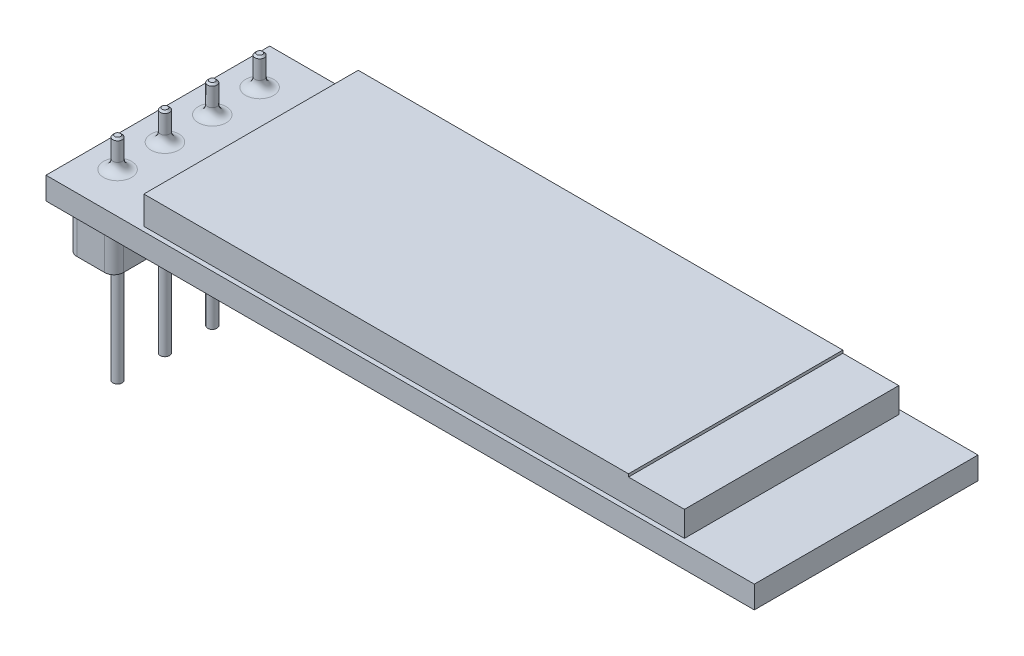
ISO-10303-21;
HEADER;
FILE_DESCRIPTION(('STEP AP214'),'2;1');
FILE_NAME('part.step','',(''),(''),'','','');
FILE_SCHEMA(('AUTOMOTIVE_DESIGN { 1 0 10303 214 1 1 1 1 }'));
ENDSEC;
DATA;
#1=APPLICATION_CONTEXT('core data for automotive mechanical design processes');
#2=APPLICATION_PROTOCOL_DEFINITION('international standard','automotive_design',2000,#1);
#3=PRODUCT_CONTEXT('',#1,'mechanical');
#4=PRODUCT('Part','Part','',(#3));
#5=PRODUCT_RELATED_PRODUCT_CATEGORY('part','',(#4));
#6=PRODUCT_DEFINITION_FORMATION('','',#4);
#7=PRODUCT_DEFINITION_CONTEXT('part definition',#1,'design');
#8=PRODUCT_DEFINITION('design','',#6,#7);
#9=PRODUCT_DEFINITION_SHAPE('','',#8);
#10=(LENGTH_UNIT() NAMED_UNIT(*) SI_UNIT(.MILLI.,.METRE.));
#11=(NAMED_UNIT(*) PLANE_ANGLE_UNIT() SI_UNIT($,.RADIAN.));
#12=(NAMED_UNIT(*) SI_UNIT($,.STERADIAN.) SOLID_ANGLE_UNIT());
#13=UNCERTAINTY_MEASURE_WITH_UNIT(LENGTH_MEASURE(1.E-05),#10,'distance_accuracy_value','');
#14=(GEOMETRIC_REPRESENTATION_CONTEXT(3) GLOBAL_UNCERTAINTY_ASSIGNED_CONTEXT((#13)) GLOBAL_UNIT_ASSIGNED_CONTEXT((#10,
#11,#12)) REPRESENTATION_CONTEXT('',''));
#15=CARTESIAN_POINT('',(0.,0.,0.));
#16=DIRECTION('',(0.,0.,1.));
#17=DIRECTION('',(1.,0.,0.));
#18=AXIS2_PLACEMENT_3D('',#15,#16,#17);
#19=CARTESIAN_POINT('',(0.,0.,0.));
#20=DIRECTION('',(0.,-1.,0.));
#21=DIRECTION('',(0.,0.,-1.));
#22=AXIS2_PLACEMENT_3D('',#19,#20,#21);
#23=PLANE('',#22);
#24=DIRECTION('',(0.,0.,-1.));
#25=VECTOR('',#24,1.);
#26=CARTESIAN_POINT('',(19.,0.,6.));
#27=LINE('',#26,#25);
#28=CARTESIAN_POINT('',(19.,0.,6.));
#29=VERTEX_POINT('',#28);
#30=CARTESIAN_POINT('',(19.,0.,-6.));
#31=VERTEX_POINT('',#30);
#32=EDGE_CURVE('E198',#29,#31,#27,.T.);
#33=ORIENTED_EDGE('',*,*,#32,.F.);
#34=DIRECTION('',(1.,0.,0.));
#35=VECTOR('',#34,1.);
#36=CARTESIAN_POINT('',(-19.,0.,6.));
#37=LINE('',#36,#35);
#38=CARTESIAN_POINT('',(-19.,0.,6.));
#39=VERTEX_POINT('',#38);
#40=EDGE_CURVE('E216',#39,#29,#37,.T.);
#41=ORIENTED_EDGE('',*,*,#40,.F.);
#42=DIRECTION('',(0.,0.,1.));
#43=VECTOR('',#42,1.);
#44=CARTESIAN_POINT('',(-19.,0.,6.));
#45=LINE('',#44,#43);
#46=CARTESIAN_POINT('',(-19.,0.,-6.));
#47=VERTEX_POINT('',#46);
#48=EDGE_CURVE('E228',#47,#39,#45,.T.);
#49=ORIENTED_EDGE('',*,*,#48,.F.);
#50=DIRECTION('',(-1.,0.,0.));
#51=VECTOR('',#50,1.);
#52=CARTESIAN_POINT('',(-19.,0.,-6.));
#53=LINE('',#52,#51);
#54=EDGE_CURVE('E204',#31,#47,#53,.T.);
#55=ORIENTED_EDGE('',*,*,#54,.F.);
#56=EDGE_LOOP('',(#33,#41,#49,#55));
#57=FACE_BOUND('',#56,.T.);
#58=DIRECTION('',(-1.,0.,0.));
#59=VECTOR('',#58,1.);
#60=CARTESIAN_POINT('',(-18.6,0.,5.25));
#61=LINE('',#60,#59);
#62=CARTESIAN_POINT('',(-16.6,0.,5.25));
#63=VERTEX_POINT('',#62);
#64=CARTESIAN_POINT('',(-18.1,0.,5.25));
#65=VERTEX_POINT('',#64);
#66=EDGE_CURVE('E467',#63,#65,#61,.T.);
#67=ORIENTED_EDGE('',*,*,#66,.F.);
#68=CARTESIAN_POINT('',(-16.6,0.,4.75));
#69=DIRECTION('',(0.,-1.,0.));
#70=DIRECTION('',(0.,0.,-1.));
#71=AXIS2_PLACEMENT_3D('',#68,#69,#70);
#72=CIRCLE('',#71,0.5);
#73=CARTESIAN_POINT('',(-16.1,0.,4.75));
#74=VERTEX_POINT('',#73);
#75=EDGE_CURVE('E350',#63,#74,#72,.F.);
#76=ORIENTED_EDGE('',*,*,#75,.T.);
#77=DIRECTION('',(0.,0.,1.));
#78=VECTOR('',#77,1.);
#79=CARTESIAN_POINT('',(-16.1,0.,5.25));
#80=LINE('',#79,#78);
#81=CARTESIAN_POINT('',(-16.1,0.,-4.74999999999999));
#82=VERTEX_POINT('',#81);
#83=EDGE_CURVE('E446',#82,#74,#80,.T.);
#84=ORIENTED_EDGE('',*,*,#83,.F.);
#85=CARTESIAN_POINT('',(-16.6,0.,-4.75));
#86=DIRECTION('',(0.,-1.,0.));
#87=DIRECTION('',(0.,0.,-1.));
#88=AXIS2_PLACEMENT_3D('',#85,#86,#87);
#89=CIRCLE('',#88,0.5);
#90=CARTESIAN_POINT('',(-16.6,0.,-5.25));
#91=VERTEX_POINT('',#90);
#92=EDGE_CURVE('E55',#82,#91,#89,.F.);
#93=ORIENTED_EDGE('',*,*,#92,.T.);
#94=DIRECTION('',(1.,0.,0.));
#95=VECTOR('',#94,1.);
#96=CARTESIAN_POINT('',(-18.6,0.,-5.25));
#97=LINE('',#96,#95);
#98=CARTESIAN_POINT('',(-18.1,0.,-5.25));
#99=VERTEX_POINT('',#98);
#100=EDGE_CURVE('E369',#99,#91,#97,.T.);
#101=ORIENTED_EDGE('',*,*,#100,.F.);
#102=CARTESIAN_POINT('',(-18.1,0.,-4.75));
#103=DIRECTION('',(0.,-1.,0.));
#104=DIRECTION('',(0.,0.,-1.));
#105=AXIS2_PLACEMENT_3D('',#102,#103,#104);
#106=CIRCLE('',#105,0.5);
#107=CARTESIAN_POINT('',(-18.6,0.,-4.74999999999999));
#108=VERTEX_POINT('',#107);
#109=EDGE_CURVE('E11',#99,#108,#106,.F.);
#110=ORIENTED_EDGE('',*,*,#109,.T.);
#111=DIRECTION('',(0.,0.,-1.));
#112=VECTOR('',#111,1.);
#113=CARTESIAN_POINT('',(-18.6,0.,5.25));
#114=LINE('',#113,#112);
#115=CARTESIAN_POINT('',(-18.6,0.,4.75));
#116=VERTEX_POINT('',#115);
#117=EDGE_CURVE('E470',#116,#108,#114,.T.);
#118=ORIENTED_EDGE('',*,*,#117,.F.);
#119=CARTESIAN_POINT('',(-18.1,0.,4.75));
#120=DIRECTION('',(0.,-1.,0.));
#121=DIRECTION('',(0.,0.,-1.));
#122=AXIS2_PLACEMENT_3D('',#119,#120,#121);
#123=CIRCLE('',#122,0.5);
#124=EDGE_CURVE('E353',#116,#65,#123,.F.);
#125=ORIENTED_EDGE('',*,*,#124,.T.);
#126=EDGE_LOOP('',(#67,#76,#84,#93,#101,#110,#118,#125));
#127=FACE_BOUND('',#126,.T.);
#128=ADVANCED_FACE('F46',(#57,#127),#23,.T.);
#129=CARTESIAN_POINT('',(-17.35,2.8,-3.81));
#130=DIRECTION('',(0.,-1.,0.));
#131=DIRECTION('',(0.,0.,-1.));
#132=AXIS2_PLACEMENT_3D('',#129,#130,#131);
#133=CONICAL_SURFACE('',#132,0.150000000000008,0.785398163397434);
#134=CARTESIAN_POINT('',(-17.35,2.70000000000001,-3.81));
#135=DIRECTION('',(0.,1.,0.));
#136=DIRECTION('',(0.,0.,1.));
#137=AXIS2_PLACEMENT_3D('',#134,#135,#136);
#138=CIRCLE('',#137,0.25);
#139=CARTESIAN_POINT('',(-17.35,2.70000000000001,-3.56));
#140=VERTEX_POINT('',#139);
#141=EDGE_CURVE('E288',#140,#140,#138,.F.);
#142=ORIENTED_EDGE('',*,*,#141,.F.);
#143=EDGE_LOOP('',(#142));
#144=FACE_BOUND('',#143,.T.);
#145=CARTESIAN_POINT('',(-17.35,2.8,-3.81));
#146=DIRECTION('',(0.,1.,0.));
#147=DIRECTION('',(0.,0.,1.));
#148=AXIS2_PLACEMENT_3D('',#145,#146,#147);
#149=CIRCLE('',#148,0.150000000000008);
#150=CARTESIAN_POINT('',(-17.35,2.8,-3.65999999999999));
#151=VERTEX_POINT('',#150);
#152=EDGE_CURVE('E292',#151,#151,#149,.T.);
#153=ORIENTED_EDGE('',*,*,#152,.F.);
#154=EDGE_LOOP('',(#153));
#155=FACE_BOUND('',#154,.T.);
#156=ADVANCED_FACE('F510',(#144,#155),#133,.T.);
#157=CARTESIAN_POINT('',(-17.35,2.8,-3.81));
#158=DIRECTION('',(0.,1.,0.));
#159=DIRECTION('',(0.,0.,1.));
#160=AXIS2_PLACEMENT_3D('',#157,#158,#159);
#161=PLANE('',#160);
#162=ORIENTED_EDGE('',*,*,#152,.T.);
#163=EDGE_LOOP('',(#162));
#164=FACE_BOUND('',#163,.T.);
#165=ADVANCED_FACE('F516',(#164),#161,.T.);
#166=CARTESIAN_POINT('',(-17.35,-8.6,-3.81));
#167=DIRECTION('',(0.,1.,0.));
#168=DIRECTION('',(0.,0.,1.));
#169=AXIS2_PLACEMENT_3D('',#166,#167,#168);
#170=CYLINDRICAL_SURFACE('',#169,0.25);
#171=CARTESIAN_POINT('',(-17.35,1.7,-3.81));
#172=DIRECTION('',(0.,-1.,0.));
#173=DIRECTION('',(0.,0.,-1.));
#174=AXIS2_PLACEMENT_3D('',#171,#172,#173);
#175=CIRCLE('',#174,0.25);
#176=CARTESIAN_POINT('',(-17.35,1.7,-4.06));
#177=VERTEX_POINT('',#176);
#178=EDGE_CURVE('E284',#177,#177,#175,.F.);
#179=ORIENTED_EDGE('',*,*,#178,.T.);
#180=EDGE_LOOP('',(#179));
#181=FACE_BOUND('',#180,.T.);
#182=ORIENTED_EDGE('',*,*,#141,.T.);
#183=EDGE_LOOP('',(#182));
#184=FACE_BOUND('',#183,.T.);
#185=ADVANCED_FACE('F576',(#181,#184),#170,.T.);
#186=CARTESIAN_POINT('',(-17.35,1.7,-3.81));
#187=DIRECTION('',(0.,-1.,0.));
#188=DIRECTION('',(0.,0.,-1.));
#189=AXIS2_PLACEMENT_3D('',#186,#187,#188);
#190=TOROIDAL_SURFACE('',#189,0.75,0.5);
#191=ORIENTED_EDGE('',*,*,#178,.F.);
#192=EDGE_LOOP('',(#191));
#193=FACE_BOUND('',#192,.T.);
#194=CARTESIAN_POINT('',(-17.35,1.2,-3.81));
#195=DIRECTION('',(0.,-1.,0.));
#196=DIRECTION('',(0.,0.,-1.));
#197=AXIS2_PLACEMENT_3D('',#194,#195,#196);
#198=CIRCLE('',#197,0.75);
#199=CARTESIAN_POINT('',(-17.35,1.2,-4.56));
#200=VERTEX_POINT('',#199);
#201=EDGE_CURVE('E280',#200,#200,#198,.T.);
#202=ORIENTED_EDGE('',*,*,#201,.F.);
#203=EDGE_LOOP('',(#202));
#204=FACE_BOUND('',#203,.T.);
#205=ADVANCED_FACE('F572',(#193,#204),#190,.F.);
#206=CARTESIAN_POINT('',(-17.35,2.8,-1.27));
#207=DIRECTION('',(0.,-1.,0.));
#208=DIRECTION('',(0.,0.,-1.));
#209=AXIS2_PLACEMENT_3D('',#206,#207,#208);
#210=CONICAL_SURFACE('',#209,0.150000000000008,0.785398163397434);
#211=CARTESIAN_POINT('',(-17.35,2.70000000000001,-1.27));
#212=DIRECTION('',(0.,1.,0.));
#213=DIRECTION('',(0.,0.,1.));
#214=AXIS2_PLACEMENT_3D('',#211,#212,#213);
#215=CIRCLE('',#214,0.25);
#216=CARTESIAN_POINT('',(-17.35,2.70000000000001,-1.02));
#217=VERTEX_POINT('',#216);
#218=EDGE_CURVE('E272',#217,#217,#215,.F.);
#219=ORIENTED_EDGE('',*,*,#218,.F.);
#220=EDGE_LOOP('',(#219));
#221=FACE_BOUND('',#220,.T.);
#222=CARTESIAN_POINT('',(-17.35,2.8,-1.27));
#223=DIRECTION('',(0.,1.,0.));
#224=DIRECTION('',(0.,0.,1.));
#225=AXIS2_PLACEMENT_3D('',#222,#223,#224);
#226=CIRCLE('',#225,0.150000000000008);
#227=CARTESIAN_POINT('',(-17.35,2.8,-1.11999999999999));
#228=VERTEX_POINT('',#227);
#229=EDGE_CURVE('E276',#228,#228,#226,.T.);
#230=ORIENTED_EDGE('',*,*,#229,.F.);
#231=EDGE_LOOP('',(#230));
#232=FACE_BOUND('',#231,.T.);
#233=ADVANCED_FACE('F564',(#221,#232),#210,.T.);
#234=CARTESIAN_POINT('',(-17.35,2.8,-1.27));
#235=DIRECTION('',(0.,1.,0.));
#236=DIRECTION('',(0.,0.,1.));
#237=AXIS2_PLACEMENT_3D('',#234,#235,#236);
#238=PLANE('',#237);
#239=ORIENTED_EDGE('',*,*,#229,.T.);
#240=EDGE_LOOP('',(#239));
#241=FACE_BOUND('',#240,.T.);
#242=ADVANCED_FACE('F560',(#241),#238,.T.);
#243=CARTESIAN_POINT('',(-17.35,-8.6,-1.27));
#244=DIRECTION('',(0.,1.,0.));
#245=DIRECTION('',(0.,0.,1.));
#246=AXIS2_PLACEMENT_3D('',#243,#244,#245);
#247=CYLINDRICAL_SURFACE('',#246,0.25);
#248=CARTESIAN_POINT('',(-17.35,1.7,-1.27));
#249=DIRECTION('',(0.,-1.,0.));
#250=DIRECTION('',(0.,0.,-1.));
#251=AXIS2_PLACEMENT_3D('',#248,#249,#250);
#252=CIRCLE('',#251,0.25);
#253=CARTESIAN_POINT('',(-17.35,1.7,-1.52));
#254=VERTEX_POINT('',#253);
#255=EDGE_CURVE('E268',#254,#254,#252,.F.);
#256=ORIENTED_EDGE('',*,*,#255,.T.);
#257=EDGE_LOOP('',(#256));
#258=FACE_BOUND('',#257,.T.);
#259=ORIENTED_EDGE('',*,*,#218,.T.);
#260=EDGE_LOOP('',(#259));
#261=FACE_BOUND('',#260,.T.);
#262=ADVANCED_FACE('F556',(#258,#261),#247,.T.);
#263=CARTESIAN_POINT('',(-17.35,1.7,-1.27));
#264=DIRECTION('',(0.,-1.,0.));
#265=DIRECTION('',(0.,0.,-1.));
#266=AXIS2_PLACEMENT_3D('',#263,#264,#265);
#267=TOROIDAL_SURFACE('',#266,0.75,0.5);
#268=ORIENTED_EDGE('',*,*,#255,.F.);
#269=EDGE_LOOP('',(#268));
#270=FACE_BOUND('',#269,.T.);
#271=CARTESIAN_POINT('',(-17.35,1.2,-1.27));
#272=DIRECTION('',(0.,-1.,0.));
#273=DIRECTION('',(0.,0.,-1.));
#274=AXIS2_PLACEMENT_3D('',#271,#272,#273);
#275=CIRCLE('',#274,0.75);
#276=CARTESIAN_POINT('',(-17.35,1.2,-2.02));
#277=VERTEX_POINT('',#276);
#278=EDGE_CURVE('E264',#277,#277,#275,.T.);
#279=ORIENTED_EDGE('',*,*,#278,.F.);
#280=EDGE_LOOP('',(#279));
#281=FACE_BOUND('',#280,.T.);
#282=ADVANCED_FACE('F553',(#270,#281),#267,.F.);
#283=CARTESIAN_POINT('',(0.,1.2,0.));
#284=DIRECTION('',(0.,-1.,0.));
#285=DIRECTION('',(0.,0.,-1.));
#286=AXIS2_PLACEMENT_3D('',#283,#284,#285);
#287=PLANE('',#286);
#288=CARTESIAN_POINT('',(-17.35,1.2,1.27));
#289=DIRECTION('',(0.,-1.,0.));
#290=DIRECTION('',(0.,0.,-1.));
#291=AXIS2_PLACEMENT_3D('',#288,#289,#290);
#292=CIRCLE('',#291,0.75);
#293=CARTESIAN_POINT('',(-17.35,1.2,0.52));
#294=VERTEX_POINT('',#293);
#295=EDGE_CURVE('E376',#294,#294,#292,.T.);
#296=ORIENTED_EDGE('',*,*,#295,.T.);
#297=EDGE_LOOP('',(#296));
#298=FACE_BOUND('',#297,.T.);
#299=CARTESIAN_POINT('',(-17.35,1.2,3.81));
#300=DIRECTION('',(0.,-1.,0.));
#301=DIRECTION('',(0.,0.,-1.));
#302=AXIS2_PLACEMENT_3D('',#299,#300,#301);
#303=CIRCLE('',#302,0.75);
#304=CARTESIAN_POINT('',(-17.35,1.2,3.06));
#305=VERTEX_POINT('',#304);
#306=EDGE_CURVE('E256',#305,#305,#303,.T.);
#307=ORIENTED_EDGE('',*,*,#306,.T.);
#308=EDGE_LOOP('',(#307));
#309=FACE_BOUND('',#308,.T.);
#310=DIRECTION('',(0.,0.,-1.));
#311=VECTOR('',#310,1.);
#312=CARTESIAN_POINT('',(19.,1.2,6.));
#313=LINE('',#312,#311);
#314=CARTESIAN_POINT('',(19.,1.2,6.));
#315=VERTEX_POINT('',#314);
#316=CARTESIAN_POINT('',(19.,1.2,-6.));
#317=VERTEX_POINT('',#316);
#318=EDGE_CURVE('E211',#315,#317,#313,.T.);
#319=ORIENTED_EDGE('',*,*,#318,.T.);
#320=DIRECTION('',(-1.,0.,0.));
#321=VECTOR('',#320,1.);
#322=CARTESIAN_POINT('',(-19.,1.2,-6.));
#323=LINE('',#322,#321);
#324=CARTESIAN_POINT('',(-19.,1.2,-6.));
#325=VERTEX_POINT('',#324);
#326=EDGE_CURVE('E215',#317,#325,#323,.T.);
#327=ORIENTED_EDGE('',*,*,#326,.T.);
#328=DIRECTION('',(0.,0.,1.));
#329=VECTOR('',#328,1.);
#330=CARTESIAN_POINT('',(-19.,1.2,6.));
#331=LINE('',#330,#329);
#332=CARTESIAN_POINT('',(-19.,1.2,6.));
#333=VERTEX_POINT('',#332);
#334=EDGE_CURVE('E219',#325,#333,#331,.T.);
#335=ORIENTED_EDGE('',*,*,#334,.T.);
#336=DIRECTION('',(1.,0.,0.));
#337=VECTOR('',#336,1.);
#338=CARTESIAN_POINT('',(-19.,1.2,6.));
#339=LINE('',#338,#337);
#340=EDGE_CURVE('E222',#333,#315,#339,.T.);
#341=ORIENTED_EDGE('',*,*,#340,.T.);
#342=EDGE_LOOP('',(#319,#327,#335,#341));
#343=FACE_BOUND('',#342,.T.);
#344=DIRECTION('',(0.,0.,-1.));
#345=VECTOR('',#344,1.);
#346=CARTESIAN_POINT('',(15.,1.2,5.75));
#347=LINE('',#346,#345);
#348=CARTESIAN_POINT('',(15.,1.2,5.75));
#349=VERTEX_POINT('',#348);
#350=CARTESIAN_POINT('',(15.,1.2,-5.75));
#351=VERTEX_POINT('',#350);
#352=EDGE_CURVE('E196',#349,#351,#347,.T.);
#353=ORIENTED_EDGE('',*,*,#352,.F.);
#354=DIRECTION('',(1.,0.,0.));
#355=VECTOR('',#354,1.);
#356=CARTESIAN_POINT('',(-14.,1.2,5.75));
#357=LINE('',#356,#355);
#358=CARTESIAN_POINT('',(-14.,1.2,5.75));
#359=VERTEX_POINT('',#358);
#360=EDGE_CURVE('E401',#359,#349,#357,.T.);
#361=ORIENTED_EDGE('',*,*,#360,.F.);
#362=DIRECTION('',(0.,0.,1.));
#363=VECTOR('',#362,1.);
#364=CARTESIAN_POINT('',(-14.,1.2,5.75));
#365=LINE('',#364,#363);
#366=CARTESIAN_POINT('',(-14.,1.2,-5.75));
#367=VERTEX_POINT('',#366);
#368=EDGE_CURVE('E414',#367,#359,#365,.T.);
#369=ORIENTED_EDGE('',*,*,#368,.F.);
#370=DIRECTION('',(-1.,0.,0.));
#371=VECTOR('',#370,1.);
#372=CARTESIAN_POINT('',(-14.,1.2,-5.75));
#373=LINE('',#372,#371);
#374=EDGE_CURVE('E411',#351,#367,#373,.T.);
#375=ORIENTED_EDGE('',*,*,#374,.F.);
#376=EDGE_LOOP('',(#353,#361,#369,#375));
#377=FACE_BOUND('',#376,.T.);
#378=ORIENTED_EDGE('',*,*,#278,.T.);
#379=EDGE_LOOP('',(#378));
#380=FACE_BOUND('',#379,.T.);
#381=ORIENTED_EDGE('',*,*,#201,.T.);
#382=EDGE_LOOP('',(#381));
#383=FACE_BOUND('',#382,.T.);
#384=ADVANCED_FACE('F434',(#298,#309,#343,#377,#380,#383),#287,.F.);
#385=CARTESIAN_POINT('',(19.,1.2,6.));
#386=DIRECTION('',(-1.,0.,0.));
#387=DIRECTION('',(0.,0.,1.));
#388=AXIS2_PLACEMENT_3D('',#385,#386,#387);
#389=PLANE('',#388);
#390=ORIENTED_EDGE('',*,*,#32,.T.);
#391=DIRECTION('',(0.,-1.,0.));
#392=VECTOR('',#391,1.);
#393=CARTESIAN_POINT('',(19.,1.2,-6.));
#394=LINE('',#393,#392);
#395=EDGE_CURVE('E244',#317,#31,#394,.T.);
#396=ORIENTED_EDGE('',*,*,#395,.F.);
#397=ORIENTED_EDGE('',*,*,#318,.F.);
#398=DIRECTION('',(0.,-1.,0.));
#399=VECTOR('',#398,1.);
#400=CARTESIAN_POINT('',(19.,1.2,6.));
#401=LINE('',#400,#399);
#402=EDGE_CURVE('E224',#315,#29,#401,.T.);
#403=ORIENTED_EDGE('',*,*,#402,.T.);
#404=EDGE_LOOP('',(#390,#396,#397,#403));
#405=FACE_BOUND('',#404,.T.);
#406=ADVANCED_FACE('F534',(#405),#389,.F.);
#407=CARTESIAN_POINT('',(-19.,1.2,-6.));
#408=DIRECTION('',(0.,0.,1.));
#409=DIRECTION('',(1.,0.,0.));
#410=AXIS2_PLACEMENT_3D('',#407,#408,#409);
#411=PLANE('',#410);
#412=ORIENTED_EDGE('',*,*,#54,.T.);
#413=DIRECTION('',(0.,-1.,0.));
#414=VECTOR('',#413,1.);
#415=CARTESIAN_POINT('',(-19.,1.2,-6.));
#416=LINE('',#415,#414);
#417=EDGE_CURVE('E240',#325,#47,#416,.T.);
#418=ORIENTED_EDGE('',*,*,#417,.F.);
#419=ORIENTED_EDGE('',*,*,#326,.F.);
#420=ORIENTED_EDGE('',*,*,#395,.T.);
#421=EDGE_LOOP('',(#412,#418,#419,#420));
#422=FACE_BOUND('',#421,.T.);
#423=ADVANCED_FACE('F530',(#422),#411,.F.);
#424=CARTESIAN_POINT('',(-19.,1.2,6.));
#425=DIRECTION('',(1.,0.,0.));
#426=DIRECTION('',(0.,0.,-1.));
#427=AXIS2_PLACEMENT_3D('',#424,#425,#426);
#428=PLANE('',#427);
#429=ORIENTED_EDGE('',*,*,#48,.T.);
#430=DIRECTION('',(0.,-1.,0.));
#431=VECTOR('',#430,1.);
#432=CARTESIAN_POINT('',(-19.,1.2,6.));
#433=LINE('',#432,#431);
#434=EDGE_CURVE('E236',#333,#39,#433,.T.);
#435=ORIENTED_EDGE('',*,*,#434,.F.);
#436=ORIENTED_EDGE('',*,*,#334,.F.);
#437=ORIENTED_EDGE('',*,*,#417,.T.);
#438=EDGE_LOOP('',(#429,#435,#436,#437));
#439=FACE_BOUND('',#438,.T.);
#440=ADVANCED_FACE('F526',(#439),#428,.F.);
#441=CARTESIAN_POINT('',(-19.,1.2,6.));
#442=DIRECTION('',(0.,0.,-1.));
#443=DIRECTION('',(-1.,0.,0.));
#444=AXIS2_PLACEMENT_3D('',#441,#442,#443);
#445=PLANE('',#444);
#446=ORIENTED_EDGE('',*,*,#40,.T.);
#447=ORIENTED_EDGE('',*,*,#402,.F.);
#448=ORIENTED_EDGE('',*,*,#340,.F.);
#449=ORIENTED_EDGE('',*,*,#434,.T.);
#450=EDGE_LOOP('',(#446,#447,#448,#449));
#451=FACE_BOUND('',#450,.T.);
#452=ADVANCED_FACE('F523',(#451),#445,.F.);
#453=CARTESIAN_POINT('',(15.,2.7,5.75));
#454=DIRECTION('',(-1.,0.,0.));
#455=DIRECTION('',(0.,0.,1.));
#456=AXIS2_PLACEMENT_3D('',#453,#454,#455);
#457=PLANE('',#456);
#458=DIRECTION('',(0.,-1.,0.));
#459=VECTOR('',#458,1.);
#460=CARTESIAN_POINT('',(15.,2.7,-5.75));
#461=LINE('',#460,#459);
#462=CARTESIAN_POINT('',(15.,2.55,-5.75));
#463=VERTEX_POINT('',#462);
#464=EDGE_CURVE('E188',#463,#351,#461,.T.);
#465=ORIENTED_EDGE('',*,*,#464,.F.);
#466=DIRECTION('',(0.,0.,-1.));
#467=VECTOR('',#466,1.);
#468=CARTESIAN_POINT('',(15.,2.55,-5.75));
#469=LINE('',#468,#467);
#470=CARTESIAN_POINT('',(15.,2.55,5.75));
#471=VERTEX_POINT('',#470);
#472=EDGE_CURVE('E171',#471,#463,#469,.T.);
#473=ORIENTED_EDGE('',*,*,#472,.F.);
#474=DIRECTION('',(0.,-1.,0.));
#475=VECTOR('',#474,1.);
#476=CARTESIAN_POINT('',(15.,2.7,5.75));
#477=LINE('',#476,#475);
#478=EDGE_CURVE('E408',#471,#349,#477,.T.);
#479=ORIENTED_EDGE('',*,*,#478,.T.);
#480=ORIENTED_EDGE('',*,*,#352,.T.);
#481=EDGE_LOOP('',(#465,#473,#479,#480));
#482=FACE_BOUND('',#481,.T.);
#483=ADVANCED_FACE('F194',(#482),#457,.F.);
#484=CARTESIAN_POINT('',(-14.,2.7,-5.75));
#485=DIRECTION('',(0.,0.,1.));
#486=DIRECTION('',(1.,0.,0.));
#487=AXIS2_PLACEMENT_3D('',#484,#485,#486);
#488=PLANE('',#487);
#489=DIRECTION('',(-1.,0.,0.));
#490=VECTOR('',#489,1.);
#491=CARTESIAN_POINT('',(-14.,2.7,-5.75));
#492=LINE('',#491,#490);
#493=CARTESIAN_POINT('',(12.,2.7,-5.75));
#494=VERTEX_POINT('',#493);
#495=CARTESIAN_POINT('',(-14.,2.7,-5.75));
#496=VERTEX_POINT('',#495);
#497=EDGE_CURVE('E397',#494,#496,#492,.T.);
#498=ORIENTED_EDGE('',*,*,#497,.F.);
#499=DIRECTION('',(0.,1.,0.));
#500=VECTOR('',#499,1.);
#501=CARTESIAN_POINT('',(12.,2.55,-5.75));
#502=LINE('',#501,#500);
#503=CARTESIAN_POINT('',(12.,2.55,-5.75));
#504=VERTEX_POINT('',#503);
#505=EDGE_CURVE('E62',#504,#494,#502,.T.);
#506=ORIENTED_EDGE('',*,*,#505,.F.);
#507=DIRECTION('',(-1.,0.,0.));
#508=VECTOR('',#507,1.);
#509=CARTESIAN_POINT('',(15.,2.55,-5.75));
#510=LINE('',#509,#508);
#511=EDGE_CURVE('E175',#463,#504,#510,.T.);
#512=ORIENTED_EDGE('',*,*,#511,.F.);
#513=ORIENTED_EDGE('',*,*,#464,.T.);
#514=ORIENTED_EDGE('',*,*,#374,.T.);
#515=DIRECTION('',(0.,-1.,0.));
#516=VECTOR('',#515,1.);
#517=CARTESIAN_POINT('',(-14.,2.7,-5.75));
#518=LINE('',#517,#516);
#519=EDGE_CURVE('E199',#496,#367,#518,.T.);
#520=ORIENTED_EDGE('',*,*,#519,.F.);
#521=EDGE_LOOP('',(#498,#506,#512,#513,#514,#520));
#522=FACE_BOUND('',#521,.T.);
#523=ADVANCED_FACE('F186',(#522),#488,.F.);
#524=CARTESIAN_POINT('',(-14.,2.7,5.75));
#525=DIRECTION('',(1.,0.,0.));
#526=DIRECTION('',(0.,0.,-1.));
#527=AXIS2_PLACEMENT_3D('',#524,#525,#526);
#528=PLANE('',#527);
#529=ORIENTED_EDGE('',*,*,#368,.T.);
#530=DIRECTION('',(0.,-1.,0.));
#531=VECTOR('',#530,1.);
#532=CARTESIAN_POINT('',(-14.,2.7,5.75));
#533=LINE('',#532,#531);
#534=CARTESIAN_POINT('',(-14.,2.7,5.75));
#535=VERTEX_POINT('',#534);
#536=EDGE_CURVE('E207',#535,#359,#533,.T.);
#537=ORIENTED_EDGE('',*,*,#536,.F.);
#538=DIRECTION('',(0.,0.,1.));
#539=VECTOR('',#538,1.);
#540=CARTESIAN_POINT('',(-14.,2.7,5.75));
#541=LINE('',#540,#539);
#542=EDGE_CURVE('E400',#496,#535,#541,.T.);
#543=ORIENTED_EDGE('',*,*,#542,.F.);
#544=ORIENTED_EDGE('',*,*,#519,.T.);
#545=EDGE_LOOP('',(#529,#537,#543,#544));
#546=FACE_BOUND('',#545,.T.);
#547=ADVANCED_FACE('F431',(#546),#528,.F.);
#548=CARTESIAN_POINT('',(-14.,2.7,5.75));
#549=DIRECTION('',(0.,0.,-1.));
#550=DIRECTION('',(-1.,0.,0.));
#551=AXIS2_PLACEMENT_3D('',#548,#549,#550);
#552=PLANE('',#551);
#553=DIRECTION('',(1.,0.,0.));
#554=VECTOR('',#553,1.);
#555=CARTESIAN_POINT('',(15.,2.55,5.75));
#556=LINE('',#555,#554);
#557=CARTESIAN_POINT('',(12.,2.55,5.75));
#558=VERTEX_POINT('',#557);
#559=EDGE_CURVE('E177',#558,#471,#556,.T.);
#560=ORIENTED_EDGE('',*,*,#559,.F.);
#561=DIRECTION('',(0.,1.,0.));
#562=VECTOR('',#561,1.);
#563=CARTESIAN_POINT('',(12.,2.55,5.75));
#564=LINE('',#563,#562);
#565=CARTESIAN_POINT('',(12.,2.7,5.75));
#566=VERTEX_POINT('',#565);
#567=EDGE_CURVE('E443',#558,#566,#564,.T.);
#568=ORIENTED_EDGE('',*,*,#567,.T.);
#569=DIRECTION('',(1.,0.,0.));
#570=VECTOR('',#569,1.);
#571=CARTESIAN_POINT('',(-14.,2.7,5.75));
#572=LINE('',#571,#570);
#573=EDGE_CURVE('E404',#535,#566,#572,.T.);
#574=ORIENTED_EDGE('',*,*,#573,.F.);
#575=ORIENTED_EDGE('',*,*,#536,.T.);
#576=ORIENTED_EDGE('',*,*,#360,.T.);
#577=ORIENTED_EDGE('',*,*,#478,.F.);
#578=EDGE_LOOP('',(#560,#568,#574,#575,#576,#577));
#579=FACE_BOUND('',#578,.T.);
#580=ADVANCED_FACE('F427',(#579),#552,.F.);
#581=CARTESIAN_POINT('',(0.,2.7,0.));
#582=DIRECTION('',(0.,-1.,0.));
#583=DIRECTION('',(0.,0.,-1.));
#584=AXIS2_PLACEMENT_3D('',#581,#582,#583);
#585=PLANE('',#584);
#586=ORIENTED_EDGE('',*,*,#573,.T.);
#587=DIRECTION('',(0.,0.,1.));
#588=VECTOR('',#587,1.);
#589=CARTESIAN_POINT('',(12.,2.7,-5.75));
#590=LINE('',#589,#588);
#591=EDGE_CURVE('E182',#494,#566,#590,.T.);
#592=ORIENTED_EDGE('',*,*,#591,.F.);
#593=ORIENTED_EDGE('',*,*,#497,.T.);
#594=ORIENTED_EDGE('',*,*,#542,.T.);
#595=EDGE_LOOP('',(#586,#592,#593,#594));
#596=FACE_BOUND('',#595,.T.);
#597=ADVANCED_FACE('F437',(#596),#585,.F.);
#598=CARTESIAN_POINT('',(-17.35,-8.6,3.81));
#599=DIRECTION('',(0.,1.,0.));
#600=DIRECTION('',(0.,0.,1.));
#601=AXIS2_PLACEMENT_3D('',#598,#599,#600);
#602=CYLINDRICAL_SURFACE('',#601,0.25);
#603=CARTESIAN_POINT('',(-17.35,1.7,3.81));
#604=DIRECTION('',(0.,-1.,0.));
#605=DIRECTION('',(0.,0.,-1.));
#606=AXIS2_PLACEMENT_3D('',#603,#604,#605);
#607=CIRCLE('',#606,0.25);
#608=CARTESIAN_POINT('',(-17.35,1.7,3.56));
#609=VERTEX_POINT('',#608);
#610=EDGE_CURVE('E260',#609,#609,#607,.F.);
#611=ORIENTED_EDGE('',*,*,#610,.T.);
#612=EDGE_LOOP('',(#611));
#613=FACE_BOUND('',#612,.T.);
#614=CARTESIAN_POINT('',(-17.35,2.70000000000001,3.81));
#615=DIRECTION('',(0.,1.,0.));
#616=DIRECTION('',(0.,0.,1.));
#617=AXIS2_PLACEMENT_3D('',#614,#615,#616);
#618=CIRCLE('',#617,0.25);
#619=CARTESIAN_POINT('',(-17.35,2.70000000000001,4.06));
#620=VERTEX_POINT('',#619);
#621=EDGE_CURVE('E252',#620,#620,#618,.F.);
#622=ORIENTED_EDGE('',*,*,#621,.T.);
#623=EDGE_LOOP('',(#622));
#624=FACE_BOUND('',#623,.T.);
#625=ADVANCED_FACE('F659',(#613,#624),#602,.T.);
#626=CARTESIAN_POINT('',(-17.35,2.8,3.81));
#627=DIRECTION('',(0.,1.,0.));
#628=DIRECTION('',(0.,0.,1.));
#629=AXIS2_PLACEMENT_3D('',#626,#627,#628);
#630=PLANE('',#629);
#631=CARTESIAN_POINT('',(-17.35,2.8,3.81));
#632=DIRECTION('',(0.,1.,0.));
#633=DIRECTION('',(0.,0.,1.));
#634=AXIS2_PLACEMENT_3D('',#631,#632,#633);
#635=CIRCLE('',#634,0.150000000000008);
#636=CARTESIAN_POINT('',(-17.35,2.8,3.96000000000001));
#637=VERTEX_POINT('',#636);
#638=EDGE_CURVE('E248',#637,#637,#635,.T.);
#639=ORIENTED_EDGE('',*,*,#638,.T.);
#640=EDGE_LOOP('',(#639));
#641=FACE_BOUND('',#640,.T.);
#642=ADVANCED_FACE('F547',(#641),#630,.T.);
#643=CARTESIAN_POINT('',(-17.35,2.8,3.81));
#644=DIRECTION('',(0.,-1.,0.));
#645=DIRECTION('',(0.,0.,-1.));
#646=AXIS2_PLACEMENT_3D('',#643,#644,#645);
#647=CONICAL_SURFACE('',#646,0.150000000000008,0.785398163397434);
#648=ORIENTED_EDGE('',*,*,#621,.F.);
#649=EDGE_LOOP('',(#648));
#650=FACE_BOUND('',#649,.T.);
#651=ORIENTED_EDGE('',*,*,#638,.F.);
#652=EDGE_LOOP('',(#651));
#653=FACE_BOUND('',#652,.T.);
#654=ADVANCED_FACE('F540',(#650,#653),#647,.T.);
#655=CARTESIAN_POINT('',(-17.35,1.7,3.81));
#656=DIRECTION('',(0.,-1.,0.));
#657=DIRECTION('',(0.,0.,-1.));
#658=AXIS2_PLACEMENT_3D('',#655,#656,#657);
#659=TOROIDAL_SURFACE('',#658,0.75,0.5);
#660=ORIENTED_EDGE('',*,*,#610,.F.);
#661=EDGE_LOOP('',(#660));
#662=FACE_BOUND('',#661,.T.);
#663=ORIENTED_EDGE('',*,*,#306,.F.);
#664=EDGE_LOOP('',(#663));
#665=FACE_BOUND('',#664,.T.);
#666=ADVANCED_FACE('F546',(#662,#665),#659,.F.);
#667=CARTESIAN_POINT('',(-17.35,1.7,1.27));
#668=DIRECTION('',(0.,-1.,0.));
#669=DIRECTION('',(0.,0.,-1.));
#670=AXIS2_PLACEMENT_3D('',#667,#668,#669);
#671=TOROIDAL_SURFACE('',#670,0.75,0.5);
#672=CARTESIAN_POINT('',(-17.35,1.7,1.27));
#673=DIRECTION('',(0.,-1.,0.));
#674=DIRECTION('',(0.,0.,-1.));
#675=AXIS2_PLACEMENT_3D('',#672,#673,#674);
#676=CIRCLE('',#675,0.25);
#677=CARTESIAN_POINT('',(-17.35,1.7,1.02));
#678=VERTEX_POINT('',#677);
#679=EDGE_CURVE('E389',#678,#678,#676,.F.);
#680=ORIENTED_EDGE('',*,*,#679,.F.);
#681=EDGE_LOOP('',(#680));
#682=FACE_BOUND('',#681,.T.);
#683=ORIENTED_EDGE('',*,*,#295,.F.);
#684=EDGE_LOOP('',(#683));
#685=FACE_BOUND('',#684,.T.);
#686=ADVANCED_FACE('F551',(#682,#685),#671,.F.);
#687=CARTESIAN_POINT('',(-17.35,-8.6,1.27));
#688=DIRECTION('',(0.,1.,0.));
#689=DIRECTION('',(0.,0.,1.));
#690=AXIS2_PLACEMENT_3D('',#687,#688,#689);
#691=CYLINDRICAL_SURFACE('',#690,0.25);
#692=ORIENTED_EDGE('',*,*,#679,.T.);
#693=EDGE_LOOP('',(#692));
#694=FACE_BOUND('',#693,.T.);
#695=CARTESIAN_POINT('',(-17.35,2.70000000000001,1.27));
#696=DIRECTION('',(0.,1.,0.));
#697=DIRECTION('',(0.,0.,1.));
#698=AXIS2_PLACEMENT_3D('',#695,#696,#697);
#699=CIRCLE('',#698,0.25);
#700=CARTESIAN_POINT('',(-17.35,2.70000000000001,1.52));
#701=VERTEX_POINT('',#700);
#702=EDGE_CURVE('E381',#701,#701,#699,.F.);
#703=ORIENTED_EDGE('',*,*,#702,.T.);
#704=EDGE_LOOP('',(#703));
#705=FACE_BOUND('',#704,.T.);
#706=ADVANCED_FACE('F649',(#694,#705),#691,.T.);
#707=CARTESIAN_POINT('',(-17.35,2.8,1.27));
#708=DIRECTION('',(0.,1.,0.));
#709=DIRECTION('',(0.,0.,1.));
#710=AXIS2_PLACEMENT_3D('',#707,#708,#709);
#711=PLANE('',#710);
#712=CARTESIAN_POINT('',(-17.35,2.8,1.27));
#713=DIRECTION('',(0.,1.,0.));
#714=DIRECTION('',(0.,0.,1.));
#715=AXIS2_PLACEMENT_3D('',#712,#713,#714);
#716=CIRCLE('',#715,0.150000000000008);
#717=CARTESIAN_POINT('',(-17.35,2.8,1.42000000000001));
#718=VERTEX_POINT('',#717);
#719=EDGE_CURVE('E385',#718,#718,#716,.T.);
#720=ORIENTED_EDGE('',*,*,#719,.T.);
#721=EDGE_LOOP('',(#720));
#722=FACE_BOUND('',#721,.T.);
#723=ADVANCED_FACE('F645',(#722),#711,.T.);
#724=CARTESIAN_POINT('',(-17.35,2.8,1.27));
#725=DIRECTION('',(0.,-1.,0.));
#726=DIRECTION('',(0.,0.,-1.));
#727=AXIS2_PLACEMENT_3D('',#724,#725,#726);
#728=CONICAL_SURFACE('',#727,0.150000000000008,0.785398163397434);
#729=ORIENTED_EDGE('',*,*,#702,.F.);
#730=EDGE_LOOP('',(#729));
#731=FACE_BOUND('',#730,.T.);
#732=ORIENTED_EDGE('',*,*,#719,.F.);
#733=EDGE_LOOP('',(#732));
#734=FACE_BOUND('',#733,.T.);
#735=ADVANCED_FACE('F632',(#731,#734),#728,.T.);
#736=CARTESIAN_POINT('',(-16.1,-2.5,5.25));
#737=DIRECTION('',(-1.,0.,0.));
#738=DIRECTION('',(0.,0.,1.));
#739=AXIS2_PLACEMENT_3D('',#736,#737,#738);
#740=PLANE('',#739);
#741=ORIENTED_EDGE('',*,*,#83,.T.);
#742=DIRECTION('',(0.,1.,0.));
#743=VECTOR('',#742,1.);
#744=CARTESIAN_POINT('',(-16.1,-2.5,4.75));
#745=LINE('',#744,#743);
#746=CARTESIAN_POINT('',(-16.1,-2.5,4.75));
#747=VERTEX_POINT('',#746);
#748=EDGE_CURVE('E321',#74,#747,#745,.F.);
#749=ORIENTED_EDGE('',*,*,#748,.T.);
#750=DIRECTION('',(0.,0.,1.));
#751=VECTOR('',#750,1.);
#752=CARTESIAN_POINT('',(-16.1,-2.5,5.25));
#753=LINE('',#752,#751);
#754=CARTESIAN_POINT('',(-16.1,-2.5,-4.74999999999999));
#755=VERTEX_POINT('',#754);
#756=EDGE_CURVE('E449',#755,#747,#753,.T.);
#757=ORIENTED_EDGE('',*,*,#756,.F.);
#758=DIRECTION('',(0.,1.,0.));
#759=VECTOR('',#758,1.);
#760=CARTESIAN_POINT('',(-16.1,-2.5,-4.75));
#761=LINE('',#760,#759);
#762=EDGE_CURVE('E317',#755,#82,#761,.T.);
#763=ORIENTED_EDGE('',*,*,#762,.T.);
#764=EDGE_LOOP('',(#741,#749,#757,#763));
#765=FACE_BOUND('',#764,.T.);
#766=ADVANCED_FACE('F491',(#765),#740,.F.);
#767=CARTESIAN_POINT('',(-18.6,-2.5,5.25));
#768=DIRECTION('',(0.,0.,-1.));
#769=DIRECTION('',(-1.,0.,0.));
#770=AXIS2_PLACEMENT_3D('',#767,#768,#769);
#771=PLANE('',#770);
#772=DIRECTION('',(-1.,0.,0.));
#773=VECTOR('',#772,1.);
#774=CARTESIAN_POINT('',(-18.6,-2.5,5.25));
#775=LINE('',#774,#773);
#776=CARTESIAN_POINT('',(-16.6,-2.5,5.25));
#777=VERTEX_POINT('',#776);
#778=CARTESIAN_POINT('',(-18.1,-2.5,5.25));
#779=VERTEX_POINT('',#778);
#780=EDGE_CURVE('E453',#777,#779,#775,.T.);
#781=ORIENTED_EDGE('',*,*,#780,.F.);
#782=DIRECTION('',(0.,1.,0.));
#783=VECTOR('',#782,1.);
#784=CARTESIAN_POINT('',(-16.6,-2.5,5.25));
#785=LINE('',#784,#783);
#786=EDGE_CURVE('E312',#777,#63,#785,.T.);
#787=ORIENTED_EDGE('',*,*,#786,.T.);
#788=ORIENTED_EDGE('',*,*,#66,.T.);
#789=DIRECTION('',(0.,1.,0.));
#790=VECTOR('',#789,1.);
#791=CARTESIAN_POINT('',(-18.1,-2.5,5.25));
#792=LINE('',#791,#790);
#793=EDGE_CURVE('E309',#65,#779,#792,.F.);
#794=ORIENTED_EDGE('',*,*,#793,.T.);
#795=EDGE_LOOP('',(#781,#787,#788,#794));
#796=FACE_BOUND('',#795,.T.);
#797=ADVANCED_FACE('F499',(#796),#771,.F.);
#798=CARTESIAN_POINT('',(-18.6,-2.5,5.25));
#799=DIRECTION('',(1.,0.,0.));
#800=DIRECTION('',(0.,0.,-1.));
#801=AXIS2_PLACEMENT_3D('',#798,#799,#800);
#802=PLANE('',#801);
#803=DIRECTION('',(0.,0.,-1.));
#804=VECTOR('',#803,1.);
#805=CARTESIAN_POINT('',(-18.6,-2.5,5.25));
#806=LINE('',#805,#804);
#807=CARTESIAN_POINT('',(-18.6,-2.5,4.75));
#808=VERTEX_POINT('',#807);
#809=CARTESIAN_POINT('',(-18.6,-2.5,-4.74999999999999));
#810=VERTEX_POINT('',#809);
#811=EDGE_CURVE('E457',#808,#810,#806,.T.);
#812=ORIENTED_EDGE('',*,*,#811,.F.);
#813=DIRECTION('',(0.,1.,0.));
#814=VECTOR('',#813,1.);
#815=CARTESIAN_POINT('',(-18.6,-2.5,4.75));
#816=LINE('',#815,#814);
#817=EDGE_CURVE('E339',#808,#116,#816,.T.);
#818=ORIENTED_EDGE('',*,*,#817,.T.);
#819=ORIENTED_EDGE('',*,*,#117,.T.);
#820=DIRECTION('',(0.,1.,0.));
#821=VECTOR('',#820,1.);
#822=CARTESIAN_POINT('',(-18.6,-2.5,-4.75));
#823=LINE('',#822,#821);
#824=EDGE_CURVE('E336',#108,#810,#823,.F.);
#825=ORIENTED_EDGE('',*,*,#824,.T.);
#826=EDGE_LOOP('',(#812,#818,#819,#825));
#827=FACE_BOUND('',#826,.T.);
#828=ADVANCED_FACE('F507',(#827),#802,.F.);
#829=CARTESIAN_POINT('',(-18.6,-2.5,-5.25));
#830=DIRECTION('',(0.,0.,1.));
#831=DIRECTION('',(1.,0.,0.));
#832=AXIS2_PLACEMENT_3D('',#829,#830,#831);
#833=PLANE('',#832);
#834=ORIENTED_EDGE('',*,*,#100,.T.);
#835=DIRECTION('',(0.,1.,0.));
#836=VECTOR('',#835,1.);
#837=CARTESIAN_POINT('',(-16.6,-2.5,-5.25));
#838=LINE('',#837,#836);
#839=CARTESIAN_POINT('',(-16.6,-2.5,-5.25));
#840=VERTEX_POINT('',#839);
#841=EDGE_CURVE('E347',#91,#840,#838,.F.);
#842=ORIENTED_EDGE('',*,*,#841,.T.);
#843=DIRECTION('',(1.,0.,0.));
#844=VECTOR('',#843,1.);
#845=CARTESIAN_POINT('',(-18.6,-2.5,-5.25));
#846=LINE('',#845,#844);
#847=CARTESIAN_POINT('',(-18.1,-2.5,-5.25));
#848=VERTEX_POINT('',#847);
#849=EDGE_CURVE('E377',#848,#840,#846,.T.);
#850=ORIENTED_EDGE('',*,*,#849,.F.);
#851=DIRECTION('',(0.,1.,0.));
#852=VECTOR('',#851,1.);
#853=CARTESIAN_POINT('',(-18.1,-2.5,-5.25));
#854=LINE('',#853,#852);
#855=EDGE_CURVE('E343',#848,#99,#854,.T.);
#856=ORIENTED_EDGE('',*,*,#855,.T.);
#857=EDGE_LOOP('',(#834,#842,#850,#856));
#858=FACE_BOUND('',#857,.T.);
#859=ADVANCED_FACE('F479',(#858),#833,.F.);
#860=CARTESIAN_POINT('',(0.,-2.5,0.));
#861=DIRECTION('',(0.,-1.,0.));
#862=DIRECTION('',(0.,0.,-1.));
#863=AXIS2_PLACEMENT_3D('',#860,#861,#862);
#864=PLANE('',#863);
#865=CARTESIAN_POINT('',(-17.35,-2.5,-3.81));
#866=DIRECTION('',(0.,-1.,0.));
#867=DIRECTION('',(0.,0.,-1.));
#868=AXIS2_PLACEMENT_3D('',#865,#866,#867);
#869=CIRCLE('',#868,0.25);
#870=CARTESIAN_POINT('',(-17.35,-2.5,-4.06));
#871=VERTEX_POINT('',#870);
#872=EDGE_CURVE('E313',#871,#871,#869,.F.);
#873=ORIENTED_EDGE('',*,*,#872,.T.);
#874=EDGE_LOOP('',(#873));
#875=FACE_BOUND('',#874,.T.);
#876=CARTESIAN_POINT('',(-17.35,-2.5,-1.27));
#877=DIRECTION('',(0.,-1.,0.));
#878=DIRECTION('',(0.,0.,-1.));
#879=AXIS2_PLACEMENT_3D('',#876,#877,#878);
#880=CIRCLE('',#879,0.25);
#881=CARTESIAN_POINT('',(-17.35,-2.5,-1.52));
#882=VERTEX_POINT('',#881);
#883=EDGE_CURVE('E359',#882,#882,#880,.F.);
#884=ORIENTED_EDGE('',*,*,#883,.T.);
#885=EDGE_LOOP('',(#884));
#886=FACE_BOUND('',#885,.T.);
#887=CARTESIAN_POINT('',(-17.35,-2.5,3.81));
#888=DIRECTION('',(0.,-1.,0.));
#889=DIRECTION('',(0.,0.,-1.));
#890=AXIS2_PLACEMENT_3D('',#887,#888,#889);
#891=CIRCLE('',#890,0.25);
#892=CARTESIAN_POINT('',(-17.35,-2.5,3.56));
#893=VERTEX_POINT('',#892);
#894=EDGE_CURVE('E308',#893,#893,#891,.F.);
#895=ORIENTED_EDGE('',*,*,#894,.T.);
#896=EDGE_LOOP('',(#895));
#897=FACE_BOUND('',#896,.T.);
#898=CARTESIAN_POINT('',(-17.35,-2.5,1.27));
#899=DIRECTION('',(0.,-1.,0.));
#900=DIRECTION('',(0.,0.,-1.));
#901=AXIS2_PLACEMENT_3D('',#898,#899,#900);
#902=CIRCLE('',#901,0.25);
#903=CARTESIAN_POINT('',(-17.35,-2.5,1.02));
#904=VERTEX_POINT('',#903);
#905=EDGE_CURVE('E304',#904,#904,#902,.F.);
#906=ORIENTED_EDGE('',*,*,#905,.T.);
#907=EDGE_LOOP('',(#906));
#908=FACE_BOUND('',#907,.T.);
#909=ORIENTED_EDGE('',*,*,#756,.T.);
#910=CARTESIAN_POINT('',(-16.6,-2.5,4.75));
#911=DIRECTION('',(0.,-1.,0.));
#912=DIRECTION('',(0.,0.,-1.));
#913=AXIS2_PLACEMENT_3D('',#910,#911,#912);
#914=CIRCLE('',#913,0.5);
#915=EDGE_CURVE('E333',#747,#777,#914,.T.);
#916=ORIENTED_EDGE('',*,*,#915,.T.);
#917=ORIENTED_EDGE('',*,*,#780,.T.);
#918=CARTESIAN_POINT('',(-18.1,-2.5,4.75));
#919=DIRECTION('',(0.,-1.,0.));
#920=DIRECTION('',(0.,0.,-1.));
#921=AXIS2_PLACEMENT_3D('',#918,#919,#920);
#922=CIRCLE('',#921,0.5);
#923=EDGE_CURVE('E330',#779,#808,#922,.T.);
#924=ORIENTED_EDGE('',*,*,#923,.T.);
#925=ORIENTED_EDGE('',*,*,#811,.T.);
#926=CARTESIAN_POINT('',(-18.1,-2.5,-4.75));
#927=DIRECTION('',(0.,-1.,0.));
#928=DIRECTION('',(0.,0.,-1.));
#929=AXIS2_PLACEMENT_3D('',#926,#927,#928);
#930=CIRCLE('',#929,0.5);
#931=EDGE_CURVE('E324',#810,#848,#930,.T.);
#932=ORIENTED_EDGE('',*,*,#931,.T.);
#933=ORIENTED_EDGE('',*,*,#849,.T.);
#934=CARTESIAN_POINT('',(-16.6,-2.5,-4.75));
#935=DIRECTION('',(0.,-1.,0.));
#936=DIRECTION('',(0.,0.,-1.));
#937=AXIS2_PLACEMENT_3D('',#934,#935,#936);
#938=CIRCLE('',#937,0.5);
#939=EDGE_CURVE('E327',#840,#755,#938,.T.);
#940=ORIENTED_EDGE('',*,*,#939,.T.);
#941=EDGE_LOOP('',(#909,#916,#917,#924,#925,#932,#933,#940));
#942=FACE_BOUND('',#941,.T.);
#943=ADVANCED_FACE('F488',(#875,#886,#897,#908,#942),#864,.T.);
#944=CARTESIAN_POINT('',(-17.35,-8.6,1.27));
#945=DIRECTION('',(0.,1.,0.));
#946=DIRECTION('',(0.,0.,1.));
#947=AXIS2_PLACEMENT_3D('',#944,#945,#946);
#948=PLANE('',#947);
#949=CARTESIAN_POINT('',(-17.35,-8.6,1.27));
#950=DIRECTION('',(0.,1.,0.));
#951=DIRECTION('',(0.,0.,1.));
#952=AXIS2_PLACEMENT_3D('',#949,#950,#951);
#953=CIRCLE('',#952,0.25);
#954=CARTESIAN_POINT('',(-17.35,-8.6,1.52));
#955=VERTEX_POINT('',#954);
#956=EDGE_CURVE('E372',#955,#955,#953,.T.);
#957=ORIENTED_EDGE('',*,*,#956,.F.);
#958=EDGE_LOOP('',(#957));
#959=FACE_BOUND('',#958,.T.);
#960=ADVANCED_FACE('F622',(#959),#948,.F.);
#961=CARTESIAN_POINT('',(-17.35,-8.6,1.27));
#962=DIRECTION('',(0.,1.,0.));
#963=DIRECTION('',(0.,0.,1.));
#964=AXIS2_PLACEMENT_3D('',#961,#962,#963);
#965=CYLINDRICAL_SURFACE('',#964,0.25);
#966=ORIENTED_EDGE('',*,*,#905,.F.);
#967=EDGE_LOOP('',(#966));
#968=FACE_BOUND('',#967,.T.);
#969=ORIENTED_EDGE('',*,*,#956,.T.);
#970=EDGE_LOOP('',(#969));
#971=FACE_BOUND('',#970,.T.);
#972=ADVANCED_FACE('F633',(#968,#971),#965,.T.);
#973=CARTESIAN_POINT('',(-17.35,-8.6,3.81));
#974=DIRECTION('',(0.,1.,0.));
#975=DIRECTION('',(0.,0.,1.));
#976=AXIS2_PLACEMENT_3D('',#973,#974,#975);
#977=PLANE('',#976);
#978=CARTESIAN_POINT('',(-17.35,-8.6,3.81));
#979=DIRECTION('',(0.,1.,0.));
#980=DIRECTION('',(0.,0.,1.));
#981=AXIS2_PLACEMENT_3D('',#978,#979,#980);
#982=CIRCLE('',#981,0.25);
#983=CARTESIAN_POINT('',(-17.35,-8.6,4.06));
#984=VERTEX_POINT('',#983);
#985=EDGE_CURVE('E393',#984,#984,#982,.T.);
#986=ORIENTED_EDGE('',*,*,#985,.F.);
#987=EDGE_LOOP('',(#986));
#988=FACE_BOUND('',#987,.T.);
#989=ADVANCED_FACE('F636',(#988),#977,.F.);
#990=ORIENTED_EDGE('',*,*,#894,.F.);
#991=EDGE_LOOP('',(#990));
#992=FACE_BOUND('',#991,.T.);
#993=ORIENTED_EDGE('',*,*,#985,.T.);
#994=EDGE_LOOP('',(#993));
#995=FACE_BOUND('',#994,.T.);
#996=ADVANCED_FACE('F590',(#992,#995),#602,.T.);
#997=CARTESIAN_POINT('',(-17.35,-8.6,-1.27));
#998=DIRECTION('',(0.,1.,0.));
#999=DIRECTION('',(0.,0.,1.));
#1000=AXIS2_PLACEMENT_3D('',#997,#998,#999);
#1001=PLANE('',#1000);
#1002=CARTESIAN_POINT('',(-17.35,-8.6,-1.27));
#1003=DIRECTION('',(0.,1.,0.));
#1004=DIRECTION('',(0.,0.,1.));
#1005=AXIS2_PLACEMENT_3D('',#1002,#1003,#1004);
#1006=CIRCLE('',#1005,0.25);
#1007=CARTESIAN_POINT('',(-17.35,-8.6,-1.02));
#1008=VERTEX_POINT('',#1007);
#1009=EDGE_CURVE('E296',#1008,#1008,#1006,.T.);
#1010=ORIENTED_EDGE('',*,*,#1009,.F.);
#1011=EDGE_LOOP('',(#1010));
#1012=FACE_BOUND('',#1011,.T.);
#1013=ADVANCED_FACE('F586',(#1012),#1001,.F.);
#1014=CARTESIAN_POINT('',(-17.35,-8.6,-1.27));
#1015=DIRECTION('',(0.,1.,0.));
#1016=DIRECTION('',(0.,0.,1.));
#1017=AXIS2_PLACEMENT_3D('',#1014,#1015,#1016);
#1018=CYLINDRICAL_SURFACE('',#1017,0.25);
#1019=ORIENTED_EDGE('',*,*,#883,.F.);
#1020=EDGE_LOOP('',(#1019));
#1021=FACE_BOUND('',#1020,.T.);
#1022=ORIENTED_EDGE('',*,*,#1009,.T.);
#1023=EDGE_LOOP('',(#1022));
#1024=FACE_BOUND('',#1023,.T.);
#1025=ADVANCED_FACE('F589',(#1021,#1024),#1018,.T.);
#1026=CARTESIAN_POINT('',(-17.35,-8.6,-3.81));
#1027=DIRECTION('',(0.,1.,0.));
#1028=DIRECTION('',(0.,0.,1.));
#1029=AXIS2_PLACEMENT_3D('',#1026,#1027,#1028);
#1030=PLANE('',#1029);
#1031=CARTESIAN_POINT('',(-17.35,-8.6,-3.81));
#1032=DIRECTION('',(0.,1.,0.));
#1033=DIRECTION('',(0.,0.,1.));
#1034=AXIS2_PLACEMENT_3D('',#1031,#1032,#1033);
#1035=CIRCLE('',#1034,0.25);
#1036=CARTESIAN_POINT('',(-17.35,-8.6,-3.56));
#1037=VERTEX_POINT('',#1036);
#1038=EDGE_CURVE('E300',#1037,#1037,#1035,.T.);
#1039=ORIENTED_EDGE('',*,*,#1038,.F.);
#1040=EDGE_LOOP('',(#1039));
#1041=FACE_BOUND('',#1040,.T.);
#1042=ADVANCED_FACE('F594',(#1041),#1030,.F.);
#1043=CARTESIAN_POINT('',(-17.35,-8.6,-3.81));
#1044=DIRECTION('',(0.,1.,0.));
#1045=DIRECTION('',(0.,0.,1.));
#1046=AXIS2_PLACEMENT_3D('',#1043,#1044,#1045);
#1047=CYLINDRICAL_SURFACE('',#1046,0.25);
#1048=ORIENTED_EDGE('',*,*,#872,.F.);
#1049=EDGE_LOOP('',(#1048));
#1050=FACE_BOUND('',#1049,.T.);
#1051=ORIENTED_EDGE('',*,*,#1038,.T.);
#1052=EDGE_LOOP('',(#1051));
#1053=FACE_BOUND('',#1052,.T.);
#1054=ADVANCED_FACE('F598',(#1050,#1053),#1047,.T.);
#1055=CARTESIAN_POINT('',(-16.6,-2.5,4.75));
#1056=DIRECTION('',(0.,1.,0.));
#1057=DIRECTION('',(0.,0.,1.));
#1058=AXIS2_PLACEMENT_3D('',#1055,#1056,#1057);
#1059=CYLINDRICAL_SURFACE('',#1058,0.5);
#1060=ORIENTED_EDGE('',*,*,#915,.F.);
#1061=ORIENTED_EDGE('',*,*,#748,.F.);
#1062=ORIENTED_EDGE('',*,*,#75,.F.);
#1063=ORIENTED_EDGE('',*,*,#786,.F.);
#1064=EDGE_LOOP('',(#1060,#1061,#1062,#1063));
#1065=FACE_BOUND('',#1064,.T.);
#1066=ADVANCED_FACE('F494',(#1065),#1059,.T.);
#1067=CARTESIAN_POINT('',(-18.1,-2.5,4.75));
#1068=DIRECTION('',(0.,1.,0.));
#1069=DIRECTION('',(0.,0.,1.));
#1070=AXIS2_PLACEMENT_3D('',#1067,#1068,#1069);
#1071=CYLINDRICAL_SURFACE('',#1070,0.5);
#1072=ORIENTED_EDGE('',*,*,#923,.F.);
#1073=ORIENTED_EDGE('',*,*,#793,.F.);
#1074=ORIENTED_EDGE('',*,*,#124,.F.);
#1075=ORIENTED_EDGE('',*,*,#817,.F.);
#1076=EDGE_LOOP('',(#1072,#1073,#1074,#1075));
#1077=FACE_BOUND('',#1076,.T.);
#1078=ADVANCED_FACE('F503',(#1077),#1071,.T.);
#1079=CARTESIAN_POINT('',(-16.6,-2.5,-4.75));
#1080=DIRECTION('',(0.,1.,0.));
#1081=DIRECTION('',(0.,0.,1.));
#1082=AXIS2_PLACEMENT_3D('',#1079,#1080,#1081);
#1083=CYLINDRICAL_SURFACE('',#1082,0.5);
#1084=ORIENTED_EDGE('',*,*,#939,.F.);
#1085=ORIENTED_EDGE('',*,*,#841,.F.);
#1086=ORIENTED_EDGE('',*,*,#92,.F.);
#1087=ORIENTED_EDGE('',*,*,#762,.F.);
#1088=EDGE_LOOP('',(#1084,#1085,#1086,#1087));
#1089=FACE_BOUND('',#1088,.T.);
#1090=ADVANCED_FACE('F484',(#1089),#1083,.T.);
#1091=CARTESIAN_POINT('',(-18.1,-2.5,-4.75));
#1092=DIRECTION('',(0.,1.,0.));
#1093=DIRECTION('',(0.,0.,1.));
#1094=AXIS2_PLACEMENT_3D('',#1091,#1092,#1093);
#1095=CYLINDRICAL_SURFACE('',#1094,0.5);
#1096=ORIENTED_EDGE('',*,*,#931,.F.);
#1097=ORIENTED_EDGE('',*,*,#824,.F.);
#1098=ORIENTED_EDGE('',*,*,#109,.F.);
#1099=ORIENTED_EDGE('',*,*,#855,.F.);
#1100=EDGE_LOOP('',(#1096,#1097,#1098,#1099));
#1101=FACE_BOUND('',#1100,.T.);
#1102=ADVANCED_FACE('F48',(#1101),#1095,.T.);
#1103=CARTESIAN_POINT('',(12.,2.55,-5.75));
#1104=DIRECTION('',(-1.,0.,0.));
#1105=DIRECTION('',(0.,0.,1.));
#1106=AXIS2_PLACEMENT_3D('',#1103,#1104,#1105);
#1107=PLANE('',#1106);
#1108=ORIENTED_EDGE('',*,*,#591,.T.);
#1109=ORIENTED_EDGE('',*,*,#567,.F.);
#1110=DIRECTION('',(0.,0.,1.));
#1111=VECTOR('',#1110,1.);
#1112=CARTESIAN_POINT('',(12.,2.55,-5.75));
#1113=LINE('',#1112,#1111);
#1114=EDGE_CURVE('E191',#504,#558,#1113,.T.);
#1115=ORIENTED_EDGE('',*,*,#1114,.F.);
#1116=ORIENTED_EDGE('',*,*,#505,.T.);
#1117=EDGE_LOOP('',(#1108,#1109,#1115,#1116));
#1118=FACE_BOUND('',#1117,.T.);
#1119=ADVANCED_FACE('F610',(#1118),#1107,.F.);
#1120=CARTESIAN_POINT('',(0.,2.55,0.));
#1121=DIRECTION('',(0.,-1.,0.));
#1122=DIRECTION('',(0.,0.,-1.));
#1123=AXIS2_PLACEMENT_3D('',#1120,#1121,#1122);
#1124=PLANE('',#1123);
#1125=ORIENTED_EDGE('',*,*,#472,.T.);
#1126=ORIENTED_EDGE('',*,*,#511,.T.);
#1127=ORIENTED_EDGE('',*,*,#1114,.T.);
#1128=ORIENTED_EDGE('',*,*,#559,.T.);
#1129=EDGE_LOOP('',(#1125,#1126,#1127,#1128));
#1130=FACE_BOUND('',#1129,.T.);
#1131=ADVANCED_FACE('F173',(#1130),#1124,.F.);
#1132=CLOSED_SHELL('',(#128,#156,#165,#185,#205,#233,#242,#262,#282,#384,#406,#423,#440,#452,
#483,#523,#547,#580,#597,#625,#642,#654,#666,#686,#706,#723,#735,#766,#797,#828,#859,#943,#960,
#972,#989,#996,#1013,#1025,#1042,#1054,#1066,#1078,#1090,#1102,#1119,#1131));
#1133=MANIFOLD_SOLID_BREP('B2',#1132);
#1134=ADVANCED_BREP_SHAPE_REPRESENTATION('',(#18,#1133),#14);
#1135=SHAPE_DEFINITION_REPRESENTATION(#9,#1134);
ENDSEC;
END-ISO-10303-21;
